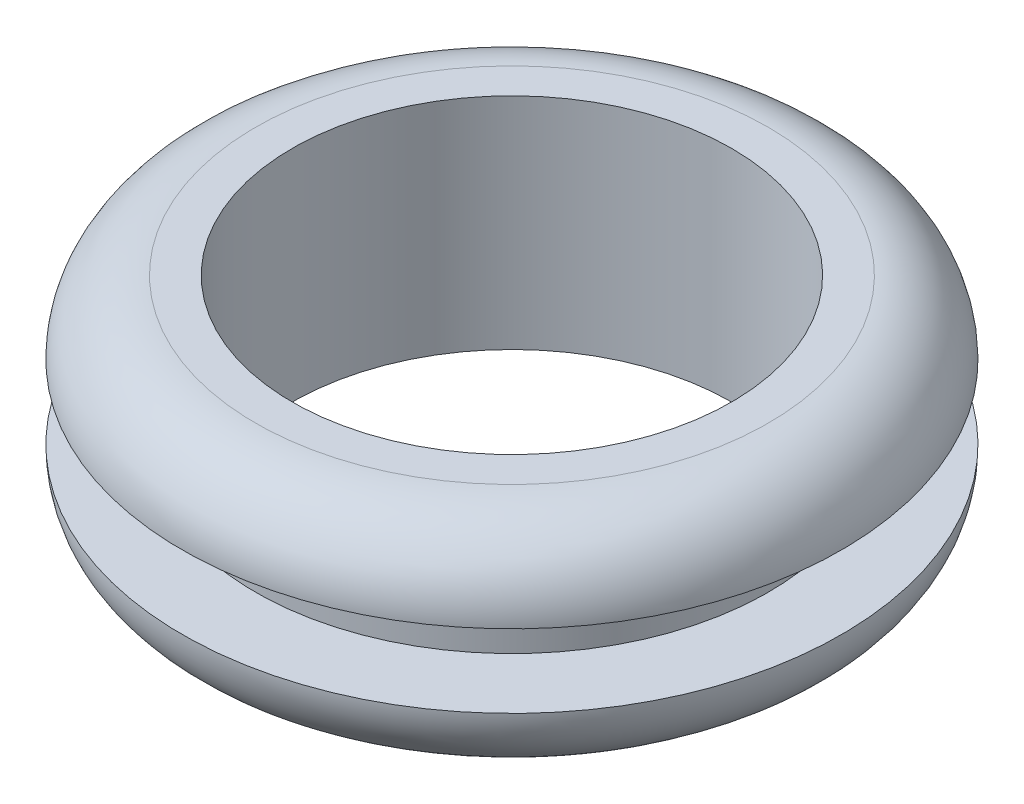
ISO-10303-21;
HEADER;
FILE_DESCRIPTION(('STEP AP214'),'2;1');
FILE_NAME('part.step','',(''),(''),'','','');
FILE_SCHEMA(('AUTOMOTIVE_DESIGN { 1 0 10303 214 1 1 1 1 }'));
ENDSEC;
DATA;
#1=APPLICATION_CONTEXT('core data for automotive mechanical design processes');
#2=APPLICATION_PROTOCOL_DEFINITION('international standard','automotive_design',2000,#1);
#3=PRODUCT_CONTEXT('',#1,'mechanical');
#4=PRODUCT('Part','Part','',(#3));
#5=PRODUCT_RELATED_PRODUCT_CATEGORY('part','',(#4));
#6=PRODUCT_DEFINITION_FORMATION('','',#4);
#7=PRODUCT_DEFINITION_CONTEXT('part definition',#1,'design');
#8=PRODUCT_DEFINITION('design','',#6,#7);
#9=PRODUCT_DEFINITION_SHAPE('','',#8);
#10=(LENGTH_UNIT() NAMED_UNIT(*) SI_UNIT(.MILLI.,.METRE.));
#11=(NAMED_UNIT(*) PLANE_ANGLE_UNIT() SI_UNIT($,.RADIAN.));
#12=(NAMED_UNIT(*) SI_UNIT($,.STERADIAN.) SOLID_ANGLE_UNIT());
#13=UNCERTAINTY_MEASURE_WITH_UNIT(LENGTH_MEASURE(1.E-05),#10,'distance_accuracy_value','');
#14=(GEOMETRIC_REPRESENTATION_CONTEXT(3) GLOBAL_UNCERTAINTY_ASSIGNED_CONTEXT((#13)) GLOBAL_UNIT_ASSIGNED_CONTEXT((#10,
#11,#12)) REPRESENTATION_CONTEXT('',''));
#15=CARTESIAN_POINT('',(0.,0.,0.));
#16=DIRECTION('',(0.,0.,1.));
#17=DIRECTION('',(1.,0.,0.));
#18=AXIS2_PLACEMENT_3D('',#15,#16,#17);
#19=CARTESIAN_POINT('',(0.,-4.7625,9.525));
#20=DIRECTION('',(0.,1.,0.));
#21=DIRECTION('',(0.,0.,1.));
#22=AXIS2_PLACEMENT_3D('',#19,#20,#21);
#23=PLANE('',#22);
#24=CARTESIAN_POINT('',(0.,-4.7625,0.));
#25=DIRECTION('',(0.,-1.,0.));
#26=DIRECTION('',(0.,0.,-1.));
#27=AXIS2_PLACEMENT_3D('',#24,#25,#26);
#28=CIRCLE('',#27,9.525);
#29=CARTESIAN_POINT('',(0.,-4.7625,-9.525));
#30=VERTEX_POINT('',#29);
#31=EDGE_CURVE('E10',#30,#30,#28,.T.);
#32=ORIENTED_EDGE('',*,*,#31,.F.);
#33=EDGE_LOOP('',(#32));
#34=FACE_BOUND('',#33,.T.);
#35=CARTESIAN_POINT('',(0.,-4.7625,0.));
#36=DIRECTION('',(0.,-1.,0.));
#37=DIRECTION('',(0.,0.,-1.));
#38=AXIS2_PLACEMENT_3D('',#35,#36,#37);
#39=CIRCLE('',#38,11.1125);
#40=CARTESIAN_POINT('',(0.,-4.7625,-11.1125));
#41=VERTEX_POINT('',#40);
#42=EDGE_CURVE('E70',#41,#41,#39,.T.);
#43=ORIENTED_EDGE('',*,*,#42,.T.);
#44=EDGE_LOOP('',(#43));
#45=FACE_BOUND('',#44,.T.);
#46=ADVANCED_FACE('F35',(#34,#45),#23,.F.);
#47=CARTESIAN_POINT('',(0.,-4.7625,0.));
#48=DIRECTION('',(0.,-1.,0.));
#49=DIRECTION('',(0.,0.,-1.));
#50=AXIS2_PLACEMENT_3D('',#47,#48,#49);
#51=CYLINDRICAL_SURFACE('',#50,9.525);
#52=CARTESIAN_POINT('',(0.,4.7625,0.));
#53=DIRECTION('',(0.,-1.,0.));
#54=DIRECTION('',(0.,0.,-1.));
#55=AXIS2_PLACEMENT_3D('',#52,#53,#54);
#56=CIRCLE('',#55,9.525);
#57=CARTESIAN_POINT('',(0.,4.7625,-9.525));
#58=VERTEX_POINT('',#57);
#59=EDGE_CURVE('E42',#58,#58,#56,.T.);
#60=ORIENTED_EDGE('',*,*,#59,.F.);
#61=EDGE_LOOP('',(#60));
#62=FACE_BOUND('',#61,.T.);
#63=ORIENTED_EDGE('',*,*,#31,.T.);
#64=EDGE_LOOP('',(#63));
#65=FACE_BOUND('',#64,.T.);
#66=ADVANCED_FACE('F108',(#62,#65),#51,.F.);
#67=CARTESIAN_POINT('',(0.,4.7625,9.525));
#68=DIRECTION('',(0.,-1.,0.));
#69=DIRECTION('',(0.,0.,-1.));
#70=AXIS2_PLACEMENT_3D('',#67,#68,#69);
#71=PLANE('',#70);
#72=CARTESIAN_POINT('',(0.,4.7625,0.));
#73=DIRECTION('',(0.,-1.,0.));
#74=DIRECTION('',(0.,0.,-1.));
#75=AXIS2_PLACEMENT_3D('',#72,#73,#74);
#76=CIRCLE('',#75,11.1125);
#77=CARTESIAN_POINT('',(0.,4.7625,-11.1125));
#78=VERTEX_POINT('',#77);
#79=EDGE_CURVE('E47',#78,#78,#76,.T.);
#80=ORIENTED_EDGE('',*,*,#79,.F.);
#81=EDGE_LOOP('',(#80));
#82=FACE_BOUND('',#81,.T.);
#83=ORIENTED_EDGE('',*,*,#59,.T.);
#84=EDGE_LOOP('',(#83));
#85=FACE_BOUND('',#84,.T.);
#86=ADVANCED_FACE('F103',(#82,#85),#71,.F.);
#87=CARTESIAN_POINT('',(0.,1.5875,0.));
#88=DIRECTION('',(0.,-1.,0.));
#89=DIRECTION('',(0.,0.,-1.));
#90=AXIS2_PLACEMENT_3D('',#87,#88,#89);
#91=TOROIDAL_SURFACE('',#90,11.1125,3.175);
#92=CARTESIAN_POINT('',(0.,1.5875,0.));
#93=DIRECTION('',(0.,-1.,0.));
#94=DIRECTION('',(0.,0.,-1.));
#95=AXIS2_PLACEMENT_3D('',#92,#93,#94);
#96=CIRCLE('',#95,14.2875);
#97=CARTESIAN_POINT('',(0.,1.5875,-14.2875));
#98=VERTEX_POINT('',#97);
#99=EDGE_CURVE('E52',#98,#98,#96,.T.);
#100=ORIENTED_EDGE('',*,*,#99,.F.);
#101=EDGE_LOOP('',(#100));
#102=FACE_BOUND('',#101,.T.);
#103=ORIENTED_EDGE('',*,*,#79,.T.);
#104=EDGE_LOOP('',(#103));
#105=FACE_BOUND('',#104,.T.);
#106=ADVANCED_FACE('F97',(#102,#105),#91,.T.);
#107=CARTESIAN_POINT('',(0.,1.5875,11.1125));
#108=DIRECTION('',(0.,1.,0.));
#109=DIRECTION('',(0.,0.,1.));
#110=AXIS2_PLACEMENT_3D('',#107,#108,#109);
#111=PLANE('',#110);
#112=CARTESIAN_POINT('',(0.,1.5875,0.));
#113=DIRECTION('',(0.,-1.,0.));
#114=DIRECTION('',(0.,0.,-1.));
#115=AXIS2_PLACEMENT_3D('',#112,#113,#114);
#116=CIRCLE('',#115,11.1125);
#117=CARTESIAN_POINT('',(0.,1.5875,-11.1125));
#118=VERTEX_POINT('',#117);
#119=EDGE_CURVE('E58',#118,#118,#116,.T.);
#120=ORIENTED_EDGE('',*,*,#119,.F.);
#121=EDGE_LOOP('',(#120));
#122=FACE_BOUND('',#121,.T.);
#123=ORIENTED_EDGE('',*,*,#99,.T.);
#124=EDGE_LOOP('',(#123));
#125=FACE_BOUND('',#124,.T.);
#126=ADVANCED_FACE('F91',(#122,#125),#111,.F.);
#127=CARTESIAN_POINT('',(0.,-4.7625,0.));
#128=DIRECTION('',(0.,-1.,0.));
#129=DIRECTION('',(0.,0.,-1.));
#130=AXIS2_PLACEMENT_3D('',#127,#128,#129);
#131=CYLINDRICAL_SURFACE('',#130,11.1125);
#132=CARTESIAN_POINT('',(0.,-1.5875,0.));
#133=DIRECTION('',(0.,-1.,0.));
#134=DIRECTION('',(0.,0.,-1.));
#135=AXIS2_PLACEMENT_3D('',#132,#133,#134);
#136=CIRCLE('',#135,11.1125);
#137=CARTESIAN_POINT('',(0.,-1.5875,-11.1125));
#138=VERTEX_POINT('',#137);
#139=EDGE_CURVE('E62',#138,#138,#136,.T.);
#140=ORIENTED_EDGE('',*,*,#139,.F.);
#141=EDGE_LOOP('',(#140));
#142=FACE_BOUND('',#141,.T.);
#143=ORIENTED_EDGE('',*,*,#119,.T.);
#144=EDGE_LOOP('',(#143));
#145=FACE_BOUND('',#144,.T.);
#146=ADVANCED_FACE('F85',(#142,#145),#131,.T.);
#147=CARTESIAN_POINT('',(0.,-1.5875,11.1125));
#148=DIRECTION('',(0.,-1.,0.));
#149=DIRECTION('',(0.,0.,-1.));
#150=AXIS2_PLACEMENT_3D('',#147,#148,#149);
#151=PLANE('',#150);
#152=CARTESIAN_POINT('',(0.,-1.5875,0.));
#153=DIRECTION('',(0.,-1.,0.));
#154=DIRECTION('',(0.,0.,-1.));
#155=AXIS2_PLACEMENT_3D('',#152,#153,#154);
#156=CIRCLE('',#155,14.2875);
#157=CARTESIAN_POINT('',(0.,-1.5875,-14.2875));
#158=VERTEX_POINT('',#157);
#159=EDGE_CURVE('E66',#158,#158,#156,.T.);
#160=ORIENTED_EDGE('',*,*,#159,.F.);
#161=EDGE_LOOP('',(#160));
#162=FACE_BOUND('',#161,.T.);
#163=ORIENTED_EDGE('',*,*,#139,.T.);
#164=EDGE_LOOP('',(#163));
#165=FACE_BOUND('',#164,.T.);
#166=ADVANCED_FACE('F79',(#162,#165),#151,.F.);
#167=CARTESIAN_POINT('',(0.,-1.5875,0.));
#168=DIRECTION('',(0.,-1.,0.));
#169=DIRECTION('',(0.,0.,-1.));
#170=AXIS2_PLACEMENT_3D('',#167,#168,#169);
#171=TOROIDAL_SURFACE('',#170,11.1125,3.175);
#172=ORIENTED_EDGE('',*,*,#42,.F.);
#173=EDGE_LOOP('',(#172));
#174=FACE_BOUND('',#173,.T.);
#175=ORIENTED_EDGE('',*,*,#159,.T.);
#176=EDGE_LOOP('',(#175));
#177=FACE_BOUND('',#176,.T.);
#178=ADVANCED_FACE('F76',(#174,#177),#171,.T.);
#179=CLOSED_SHELL('',(#46,#66,#86,#106,#126,#146,#166,#178));
#180=MANIFOLD_SOLID_BREP('B2',#179);
#181=ADVANCED_BREP_SHAPE_REPRESENTATION('',(#18,#180),#14);
#182=SHAPE_DEFINITION_REPRESENTATION(#9,#181);
ENDSEC;
END-ISO-10303-21;
